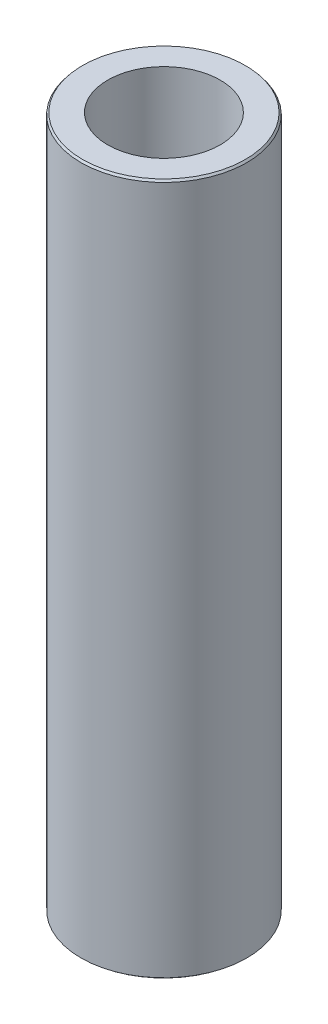
ISO-10303-21;
HEADER;
FILE_DESCRIPTION(('STEP AP214'),'2;1');
FILE_NAME('part.step','',(''),(''),'','','');
FILE_SCHEMA(('AUTOMOTIVE_DESIGN { 1 0 10303 214 1 1 1 1 }'));
ENDSEC;
DATA;
#1=APPLICATION_CONTEXT('core data for automotive mechanical design processes');
#2=APPLICATION_PROTOCOL_DEFINITION('international standard','automotive_design',2000,#1);
#3=PRODUCT_CONTEXT('',#1,'mechanical');
#4=PRODUCT('Part','Part','',(#3));
#5=PRODUCT_RELATED_PRODUCT_CATEGORY('part','',(#4));
#6=PRODUCT_DEFINITION_FORMATION('','',#4);
#7=PRODUCT_DEFINITION_CONTEXT('part definition',#1,'design');
#8=PRODUCT_DEFINITION('design','',#6,#7);
#9=PRODUCT_DEFINITION_SHAPE('','',#8);
#10=(LENGTH_UNIT() NAMED_UNIT(*) SI_UNIT(.MILLI.,.METRE.));
#11=(NAMED_UNIT(*) PLANE_ANGLE_UNIT() SI_UNIT($,.RADIAN.));
#12=(NAMED_UNIT(*) SI_UNIT($,.STERADIAN.) SOLID_ANGLE_UNIT());
#13=UNCERTAINTY_MEASURE_WITH_UNIT(LENGTH_MEASURE(1.E-05),#10,'distance_accuracy_value','');
#14=(GEOMETRIC_REPRESENTATION_CONTEXT(3) GLOBAL_UNCERTAINTY_ASSIGNED_CONTEXT((#13)) GLOBAL_UNIT_ASSIGNED_CONTEXT((#10,
#11,#12)) REPRESENTATION_CONTEXT('',''));
#15=CARTESIAN_POINT('',(0.,0.,0.));
#16=DIRECTION('',(0.,0.,1.));
#17=DIRECTION('',(1.,0.,0.));
#18=AXIS2_PLACEMENT_3D('',#15,#16,#17);
#19=CARTESIAN_POINT('',(0.,250.318759967814,0.));
#20=DIRECTION('',(0.,-1.,0.));
#21=DIRECTION('',(0.,0.,-1.));
#22=AXIS2_PLACEMENT_3D('',#19,#20,#21);
#23=CYLINDRICAL_SURFACE('',#22,30.);
#24=CARTESIAN_POINT('',(0.,249.615332814861,0.));
#25=DIRECTION('',(0.,1.,0.));
#26=DIRECTION('',(0.,0.,1.));
#27=AXIS2_PLACEMENT_3D('',#24,#25,#26);
#28=CIRCLE('',#27,30.);
#29=CARTESIAN_POINT('',(0.,249.615332814861,30.));
#30=VERTEX_POINT('',#29);
#31=EDGE_CURVE('E50',#30,#30,#28,.F.);
#32=ORIENTED_EDGE('',*,*,#31,.T.);
#33=EDGE_LOOP('',(#32));
#34=FACE_BOUND('',#33,.T.);
#35=CARTESIAN_POINT('',(0.,0.561120115933011,0.));
#36=DIRECTION('',(0.,1.,0.));
#37=DIRECTION('',(0.,0.,1.));
#38=AXIS2_PLACEMENT_3D('',#35,#36,#37);
#39=CIRCLE('',#38,30.);
#40=CARTESIAN_POINT('',(0.,0.561120115933011,30.));
#41=VERTEX_POINT('',#40);
#42=EDGE_CURVE('E51',#41,#41,#39,.T.);
#43=ORIENTED_EDGE('',*,*,#42,.T.);
#44=EDGE_LOOP('',(#43));
#45=FACE_BOUND('',#44,.T.);
#46=ADVANCED_FACE('F39',(#34,#45),#23,.T.);
#47=CARTESIAN_POINT('',(0.,250.318759967814,0.));
#48=DIRECTION('',(0.,1.,0.));
#49=DIRECTION('',(0.,0.,1.));
#50=AXIS2_PLACEMENT_3D('',#47,#48,#49);
#51=PLANE('',#50);
#52=CARTESIAN_POINT('',(0.,250.318759967814,0.));
#53=DIRECTION('',(0.,1.,0.));
#54=DIRECTION('',(0.,0.,1.));
#55=AXIS2_PLACEMENT_3D('',#52,#53,#54);
#56=CIRCLE('',#55,29.438879884067);
#57=CARTESIAN_POINT('',(0.,250.318759967814,29.438879884067));
#58=VERTEX_POINT('',#57);
#59=EDGE_CURVE('E54',#58,#58,#56,.T.);
#60=ORIENTED_EDGE('',*,*,#59,.T.);
#61=EDGE_LOOP('',(#60));
#62=FACE_BOUND('',#61,.T.);
#63=CARTESIAN_POINT('',(0.,250.318759967814,0.));
#64=DIRECTION('',(0.,1.,0.));
#65=DIRECTION('',(0.,0.,1.));
#66=AXIS2_PLACEMENT_3D('',#63,#64,#65);
#67=CIRCLE('',#66,20.325312248851);
#68=CARTESIAN_POINT('',(0.,250.318759967814,20.325312248851));
#69=VERTEX_POINT('',#68);
#70=EDGE_CURVE('E58',#69,#69,#67,.T.);
#71=ORIENTED_EDGE('',*,*,#70,.F.);
#72=EDGE_LOOP('',(#71));
#73=FACE_BOUND('',#72,.T.);
#74=ADVANCED_FACE('F69',(#62,#73),#51,.T.);
#75=CARTESIAN_POINT('',(0.,0.,0.));
#76=DIRECTION('',(0.,1.,0.));
#77=DIRECTION('',(0.,0.,1.));
#78=AXIS2_PLACEMENT_3D('',#75,#76,#77);
#79=PLANE('',#78);
#80=CARTESIAN_POINT('',(0.,0.,0.));
#81=DIRECTION('',(0.,1.,0.));
#82=DIRECTION('',(0.,0.,1.));
#83=AXIS2_PLACEMENT_3D('',#80,#81,#82);
#84=CIRCLE('',#83,29.2965728470466);
#85=CARTESIAN_POINT('',(0.,0.,29.2965728470466));
#86=VERTEX_POINT('',#85);
#87=EDGE_CURVE('E10',#86,#86,#84,.F.);
#88=ORIENTED_EDGE('',*,*,#87,.T.);
#89=EDGE_LOOP('',(#88));
#90=FACE_BOUND('',#89,.T.);
#91=CARTESIAN_POINT('',(0.,0.,0.));
#92=DIRECTION('',(0.,1.,0.));
#93=DIRECTION('',(0.,0.,1.));
#94=AXIS2_PLACEMENT_3D('',#91,#92,#93);
#95=CIRCLE('',#94,20.325312248851);
#96=CARTESIAN_POINT('',(0.,0.,20.325312248851));
#97=VERTEX_POINT('',#96);
#98=EDGE_CURVE('E63',#97,#97,#95,.T.);
#99=ORIENTED_EDGE('',*,*,#98,.T.);
#100=EDGE_LOOP('',(#99));
#101=FACE_BOUND('',#100,.T.);
#102=ADVANCED_FACE('F75',(#90,#101),#79,.F.);
#103=CARTESIAN_POINT('',(0.,250.318759967814,0.));
#104=DIRECTION('',(0.,-1.,0.));
#105=DIRECTION('',(0.,0.,-1.));
#106=AXIS2_PLACEMENT_3D('',#103,#104,#105);
#107=CYLINDRICAL_SURFACE('',#106,20.325312248851);
#108=ORIENTED_EDGE('',*,*,#70,.T.);
#109=EDGE_LOOP('',(#108));
#110=FACE_BOUND('',#109,.T.);
#111=ORIENTED_EDGE('',*,*,#98,.F.);
#112=EDGE_LOOP('',(#111));
#113=FACE_BOUND('',#112,.T.);
#114=ADVANCED_FACE('F70',(#110,#113),#107,.F.);
#115=CARTESIAN_POINT('',(0.,250.318759967814,0.));
#116=DIRECTION('',(0.,-1.,0.));
#117=DIRECTION('',(0.,0.,-1.));
#118=AXIS2_PLACEMENT_3D('',#115,#116,#117);
#119=CONICAL_SURFACE('',#118,29.438879884067,0.673333693549759);
#120=ORIENTED_EDGE('',*,*,#31,.F.);
#121=EDGE_LOOP('',(#120));
#122=FACE_BOUND('',#121,.T.);
#123=ORIENTED_EDGE('',*,*,#59,.F.);
#124=EDGE_LOOP('',(#123));
#125=FACE_BOUND('',#124,.T.);
#126=ADVANCED_FACE('F81',(#122,#125),#119,.T.);
#127=CARTESIAN_POINT('',(0.,0.561120115933011,0.));
#128=DIRECTION('',(0.,1.,0.));
#129=DIRECTION('',(0.,0.,1.));
#130=AXIS2_PLACEMENT_3D('',#127,#128,#129);
#131=CONICAL_SURFACE('',#130,30.,0.897462633245111);
#132=ORIENTED_EDGE('',*,*,#87,.F.);
#133=EDGE_LOOP('',(#132));
#134=FACE_BOUND('',#133,.T.);
#135=ORIENTED_EDGE('',*,*,#42,.F.);
#136=EDGE_LOOP('',(#135));
#137=FACE_BOUND('',#136,.T.);
#138=ADVANCED_FACE('F45',(#134,#137),#131,.T.);
#139=CLOSED_SHELL('',(#46,#74,#102,#114,#126,#138));
#140=MANIFOLD_SOLID_BREP('B2',#139);
#141=ADVANCED_BREP_SHAPE_REPRESENTATION('',(#18,#140),#14);
#142=SHAPE_DEFINITION_REPRESENTATION(#9,#141);
ENDSEC;
END-ISO-10303-21;
